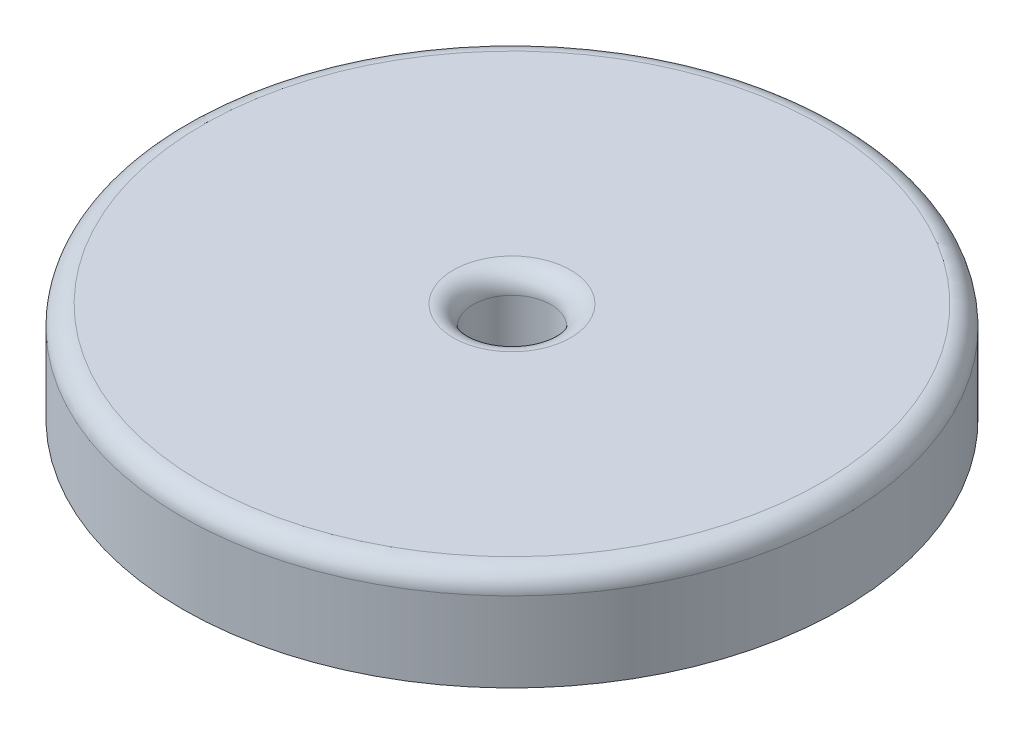
ISO-10303-21;
HEADER;
FILE_DESCRIPTION(('STEP AP214'),'2;1');
FILE_NAME('part.step','',(''),(''),'','','');
FILE_SCHEMA(('AUTOMOTIVE_DESIGN { 1 0 10303 214 1 1 1 1 }'));
ENDSEC;
DATA;
#1=APPLICATION_CONTEXT('core data for automotive mechanical design processes');
#2=APPLICATION_PROTOCOL_DEFINITION('international standard','automotive_design',2000,#1);
#3=PRODUCT_CONTEXT('',#1,'mechanical');
#4=PRODUCT('Part','Part','',(#3));
#5=PRODUCT_RELATED_PRODUCT_CATEGORY('part','',(#4));
#6=PRODUCT_DEFINITION_FORMATION('','',#4);
#7=PRODUCT_DEFINITION_CONTEXT('part definition',#1,'design');
#8=PRODUCT_DEFINITION('design','',#6,#7);
#9=PRODUCT_DEFINITION_SHAPE('','',#8);
#10=(LENGTH_UNIT() NAMED_UNIT(*) SI_UNIT(.MILLI.,.METRE.));
#11=(NAMED_UNIT(*) PLANE_ANGLE_UNIT() SI_UNIT($,.RADIAN.));
#12=(NAMED_UNIT(*) SI_UNIT($,.STERADIAN.) SOLID_ANGLE_UNIT());
#13=UNCERTAINTY_MEASURE_WITH_UNIT(LENGTH_MEASURE(1.E-05),#10,'distance_accuracy_value','');
#14=(GEOMETRIC_REPRESENTATION_CONTEXT(3) GLOBAL_UNCERTAINTY_ASSIGNED_CONTEXT((#13)) GLOBAL_UNIT_ASSIGNED_CONTEXT((#10,
#11,#12)) REPRESENTATION_CONTEXT('',''));
#15=CARTESIAN_POINT('',(0.,0.,0.));
#16=DIRECTION('',(0.,0.,1.));
#17=DIRECTION('',(1.,0.,0.));
#18=AXIS2_PLACEMENT_3D('',#15,#16,#17);
#19=CARTESIAN_POINT('',(0.,10.,0.));
#20=DIRECTION('',(0.,-1.,0.));
#21=DIRECTION('',(0.,0.,-1.));
#22=AXIS2_PLACEMENT_3D('',#19,#20,#21);
#23=CYLINDRICAL_SURFACE('',#22,33.072163115);
#24=CARTESIAN_POINT('',(0.,8.,0.));
#25=DIRECTION('',(0.,1.,0.));
#26=DIRECTION('',(0.,0.,1.));
#27=AXIS2_PLACEMENT_3D('',#24,#25,#26);
#28=CIRCLE('',#27,33.072163115);
#29=CARTESIAN_POINT('',(0.,8.,33.072163115));
#30=VERTEX_POINT('',#29);
#31=EDGE_CURVE('E56',#30,#30,#28,.F.);
#32=ORIENTED_EDGE('',*,*,#31,.T.);
#33=EDGE_LOOP('',(#32));
#34=FACE_BOUND('',#33,.T.);
#35=CARTESIAN_POINT('',(0.,0.,0.));
#36=DIRECTION('',(0.,1.,0.));
#37=DIRECTION('',(0.,0.,1.));
#38=AXIS2_PLACEMENT_3D('',#35,#36,#37);
#39=CIRCLE('',#38,33.072163115);
#40=CARTESIAN_POINT('',(0.,0.,33.072163115));
#41=VERTEX_POINT('',#40);
#42=EDGE_CURVE('E67',#41,#41,#39,.T.);
#43=ORIENTED_EDGE('',*,*,#42,.T.);
#44=EDGE_LOOP('',(#43));
#45=FACE_BOUND('',#44,.T.);
#46=ADVANCED_FACE('F43',(#34,#45),#23,.T.);
#47=CARTESIAN_POINT('',(0.,10.,0.));
#48=DIRECTION('',(0.,1.,0.));
#49=DIRECTION('',(0.,0.,1.));
#50=AXIS2_PLACEMENT_3D('',#47,#48,#49);
#51=PLANE('',#50);
#52=CARTESIAN_POINT('',(0.,10.,0.));
#53=DIRECTION('',(0.,1.,0.));
#54=DIRECTION('',(0.,0.,1.));
#55=AXIS2_PLACEMENT_3D('',#52,#53,#54);
#56=CIRCLE('',#55,5.89);
#57=CARTESIAN_POINT('',(0.,10.,5.89));
#58=VERTEX_POINT('',#57);
#59=EDGE_CURVE('E10',#58,#58,#56,.F.);
#60=ORIENTED_EDGE('',*,*,#59,.T.);
#61=EDGE_LOOP('',(#60));
#62=FACE_BOUND('',#61,.T.);
#63=CARTESIAN_POINT('',(0.,10.,0.));
#64=DIRECTION('',(0.,1.,0.));
#65=DIRECTION('',(0.,0.,1.));
#66=AXIS2_PLACEMENT_3D('',#63,#64,#65);
#67=CIRCLE('',#66,31.072163115);
#68=CARTESIAN_POINT('',(0.,10.,31.072163115));
#69=VERTEX_POINT('',#68);
#70=EDGE_CURVE('E61',#69,#69,#67,.T.);
#71=ORIENTED_EDGE('',*,*,#70,.T.);
#72=EDGE_LOOP('',(#71));
#73=FACE_BOUND('',#72,.T.);
#74=ADVANCED_FACE('F102',(#62,#73),#51,.T.);
#75=CARTESIAN_POINT('',(0.,0.,0.));
#76=DIRECTION('',(0.,1.,0.));
#77=DIRECTION('',(0.,0.,1.));
#78=AXIS2_PLACEMENT_3D('',#75,#76,#77);
#79=PLANE('',#78);
#80=CARTESIAN_POINT('',(0.,0.,0.));
#81=DIRECTION('',(0.,1.,0.));
#82=DIRECTION('',(0.,0.,1.));
#83=AXIS2_PLACEMENT_3D('',#80,#81,#82);
#84=CIRCLE('',#83,1.935);
#85=CARTESIAN_POINT('',(0.,0.,1.935));
#86=VERTEX_POINT('',#85);
#87=EDGE_CURVE('E68',#86,#86,#84,.T.);
#88=ORIENTED_EDGE('',*,*,#87,.T.);
#89=EDGE_LOOP('',(#88));
#90=FACE_BOUND('',#89,.T.);
#91=ORIENTED_EDGE('',*,*,#42,.F.);
#92=EDGE_LOOP('',(#91));
#93=FACE_BOUND('',#92,.T.);
#94=ADVANCED_FACE('F95',(#90,#93),#79,.F.);
#95=CARTESIAN_POINT('',(0.,2.00000000000001,0.));
#96=DIRECTION('',(0.,1.,0.));
#97=DIRECTION('',(0.,0.,1.));
#98=AXIS2_PLACEMENT_3D('',#95,#96,#97);
#99=CYLINDRICAL_SURFACE('',#98,3.89);
#100=CARTESIAN_POINT('',(0.,8.,0.));
#101=DIRECTION('',(0.,1.,0.));
#102=DIRECTION('',(0.,0.,1.));
#103=AXIS2_PLACEMENT_3D('',#100,#101,#102);
#104=CIRCLE('',#103,3.89);
#105=CARTESIAN_POINT('',(0.,8.,3.89));
#106=VERTEX_POINT('',#105);
#107=EDGE_CURVE('E51',#106,#106,#104,.T.);
#108=ORIENTED_EDGE('',*,*,#107,.T.);
#109=EDGE_LOOP('',(#108));
#110=FACE_BOUND('',#109,.T.);
#111=CARTESIAN_POINT('',(0.,2.00000000000001,0.));
#112=DIRECTION('',(0.,1.,0.));
#113=DIRECTION('',(0.,0.,1.));
#114=AXIS2_PLACEMENT_3D('',#111,#112,#113);
#115=CIRCLE('',#114,3.89);
#116=CARTESIAN_POINT('',(0.,2.00000000000001,3.89));
#117=VERTEX_POINT('',#116);
#118=EDGE_CURVE('E72',#117,#117,#115,.T.);
#119=ORIENTED_EDGE('',*,*,#118,.F.);
#120=EDGE_LOOP('',(#119));
#121=FACE_BOUND('',#120,.T.);
#122=ADVANCED_FACE('F90',(#110,#121),#99,.F.);
#123=CARTESIAN_POINT('',(0.,2.00000000000001,0.));
#124=DIRECTION('',(0.,1.,0.));
#125=DIRECTION('',(0.,0.,1.));
#126=AXIS2_PLACEMENT_3D('',#123,#124,#125);
#127=PLANE('',#126);
#128=CARTESIAN_POINT('',(0.,2.00000000000001,0.));
#129=DIRECTION('',(0.,1.,0.));
#130=DIRECTION('',(0.,0.,1.));
#131=AXIS2_PLACEMENT_3D('',#128,#129,#130);
#132=CIRCLE('',#131,1.935);
#133=CARTESIAN_POINT('',(0.,2.00000000000001,1.935));
#134=VERTEX_POINT('',#133);
#135=EDGE_CURVE('E73',#134,#134,#132,.T.);
#136=ORIENTED_EDGE('',*,*,#135,.F.);
#137=EDGE_LOOP('',(#136));
#138=FACE_BOUND('',#137,.T.);
#139=ORIENTED_EDGE('',*,*,#118,.T.);
#140=EDGE_LOOP('',(#139));
#141=FACE_BOUND('',#140,.T.);
#142=ADVANCED_FACE('F87',(#138,#141),#127,.T.);
#143=CARTESIAN_POINT('',(0.,-5.99999999999999,0.));
#144=DIRECTION('',(0.,1.,0.));
#145=DIRECTION('',(0.,0.,1.));
#146=AXIS2_PLACEMENT_3D('',#143,#144,#145);
#147=CYLINDRICAL_SURFACE('',#146,1.935);
#148=ORIENTED_EDGE('',*,*,#135,.T.);
#149=EDGE_LOOP('',(#148));
#150=FACE_BOUND('',#149,.T.);
#151=ORIENTED_EDGE('',*,*,#87,.F.);
#152=EDGE_LOOP('',(#151));
#153=FACE_BOUND('',#152,.T.);
#154=ADVANCED_FACE('F84',(#150,#153),#147,.F.);
#155=CARTESIAN_POINT('',(0.,8.,0.));
#156=DIRECTION('',(0.,1.,0.));
#157=DIRECTION('',(0.,0.,1.));
#158=AXIS2_PLACEMENT_3D('',#155,#156,#157);
#159=TOROIDAL_SURFACE('',#158,31.072163115,2.);
#160=ORIENTED_EDGE('',*,*,#31,.F.);
#161=EDGE_LOOP('',(#160));
#162=FACE_BOUND('',#161,.T.);
#163=ORIENTED_EDGE('',*,*,#70,.F.);
#164=EDGE_LOOP('',(#163));
#165=FACE_BOUND('',#164,.T.);
#166=ADVANCED_FACE('F114',(#162,#165),#159,.T.);
#167=CARTESIAN_POINT('',(0.,8.,0.));
#168=DIRECTION('',(0.,1.,0.));
#169=DIRECTION('',(0.,0.,1.));
#170=AXIS2_PLACEMENT_3D('',#167,#168,#169);
#171=TOROIDAL_SURFACE('',#170,5.89,2.);
#172=ORIENTED_EDGE('',*,*,#59,.F.);
#173=EDGE_LOOP('',(#172));
#174=FACE_BOUND('',#173,.T.);
#175=ORIENTED_EDGE('',*,*,#107,.F.);
#176=EDGE_LOOP('',(#175));
#177=FACE_BOUND('',#176,.T.);
#178=ADVANCED_FACE('F45',(#174,#177),#171,.T.);
#179=CLOSED_SHELL('',(#46,#74,#94,#122,#142,#154,#166,#178));
#180=MANIFOLD_SOLID_BREP('B2',#179);
#181=ADVANCED_BREP_SHAPE_REPRESENTATION('',(#18,#180),#14);
#182=SHAPE_DEFINITION_REPRESENTATION(#9,#181);
ENDSEC;
END-ISO-10303-21;
